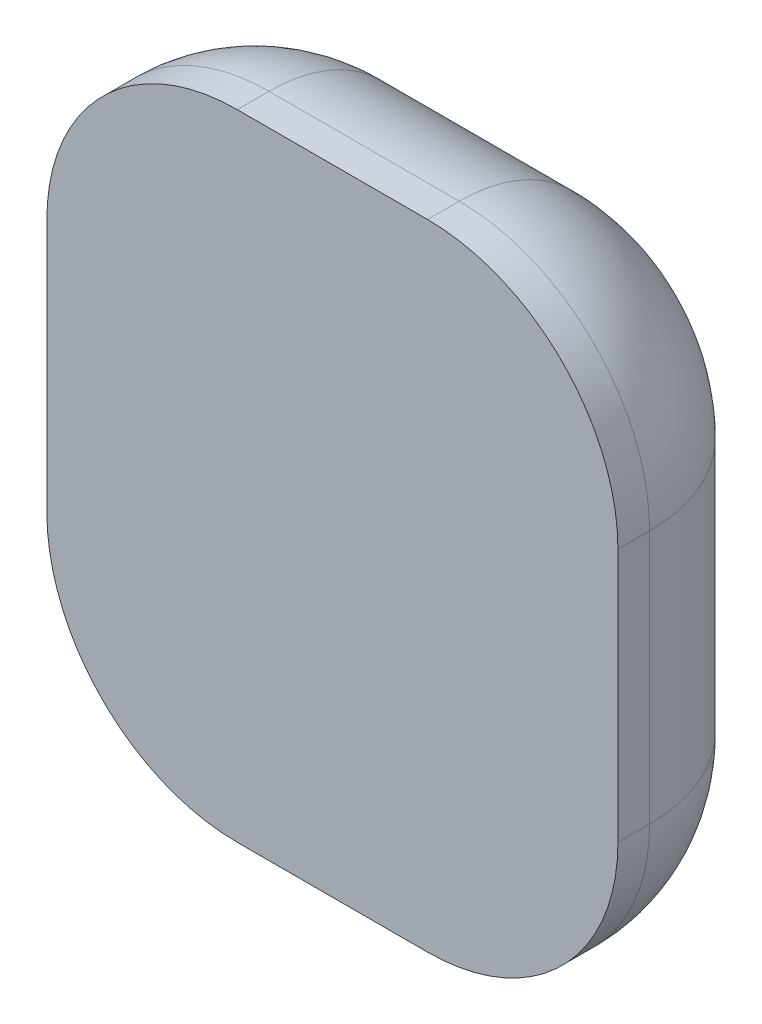
ISO-10303-21;
HEADER;
FILE_DESCRIPTION(('STEP AP214'),'2;1');
FILE_NAME('part.step','',(''),(''),'','','');
FILE_SCHEMA(('AUTOMOTIVE_DESIGN { 1 0 10303 214 1 1 1 1 }'));
ENDSEC;
DATA;
#1=APPLICATION_CONTEXT('core data for automotive mechanical design processes');
#2=APPLICATION_PROTOCOL_DEFINITION('international standard','automotive_design',2000,#1);
#3=PRODUCT_CONTEXT('',#1,'mechanical');
#4=PRODUCT('Part','Part','',(#3));
#5=PRODUCT_RELATED_PRODUCT_CATEGORY('part','',(#4));
#6=PRODUCT_DEFINITION_FORMATION('','',#4);
#7=PRODUCT_DEFINITION_CONTEXT('part definition',#1,'design');
#8=PRODUCT_DEFINITION('design','',#6,#7);
#9=PRODUCT_DEFINITION_SHAPE('','',#8);
#10=(LENGTH_UNIT() NAMED_UNIT(*) SI_UNIT(.MILLI.,.METRE.));
#11=(NAMED_UNIT(*) PLANE_ANGLE_UNIT() SI_UNIT($,.RADIAN.));
#12=(NAMED_UNIT(*) SI_UNIT($,.STERADIAN.) SOLID_ANGLE_UNIT());
#13=UNCERTAINTY_MEASURE_WITH_UNIT(LENGTH_MEASURE(1.E-05),#10,'distance_accuracy_value','');
#14=(GEOMETRIC_REPRESENTATION_CONTEXT(3) GLOBAL_UNCERTAINTY_ASSIGNED_CONTEXT((#13)) GLOBAL_UNIT_ASSIGNED_CONTEXT((#10,
#11,#12)) REPRESENTATION_CONTEXT('',''));
#15=CARTESIAN_POINT('',(0.,0.,0.));
#16=DIRECTION('',(0.,0.,1.));
#17=DIRECTION('',(1.,0.,0.));
#18=AXIS2_PLACEMENT_3D('',#15,#16,#17);
#19=CARTESIAN_POINT('',(2.94899999924089,-1.74899999924089,-7.3));
#20=DIRECTION('',(0.,0.,-1.));
#21=DIRECTION('',(1.,0.,0.));
#22=AXIS2_PLACEMENT_3D('',#19,#20,#21);
#23=PLANE('',#22);
#24=DIRECTION('',(0.,-1.,0.));
#25=VECTOR('',#24,1.);
#26=CARTESIAN_POINT('',(2.95,-2.,-7.3));
#27=LINE('',#26,#25);
#28=CARTESIAN_POINT('',(2.95,-1.8,-7.3));
#29=VERTEX_POINT('',#28);
#30=CARTESIAN_POINT('',(2.95,-2.19999999908368,-7.3));
#31=VERTEX_POINT('',#30);
#32=EDGE_CURVE('E128',#29,#31,#27,.T.);
#33=ORIENTED_EDGE('',*,*,#32,.F.);
#34=CARTESIAN_POINT('',(3.,-1.8,-7.3));
#35=DIRECTION('',(0.,0.,-1.));
#36=DIRECTION('',(-1.,0.,0.));
#37=AXIS2_PLACEMENT_3D('',#34,#35,#36);
#38=CIRCLE('',#37,0.0499999999999995);
#39=CARTESIAN_POINT('',(3.00000000091633,-1.75,-7.3));
#40=VERTEX_POINT('',#39);
#41=EDGE_CURVE('E103',#40,#29,#38,.F.);
#42=ORIENTED_EDGE('',*,*,#41,.F.);
#43=DIRECTION('',(-1.,0.,0.));
#44=VECTOR('',#43,1.);
#45=CARTESIAN_POINT('',(3.15,-1.75,-7.3));
#46=LINE('',#45,#44);
#47=CARTESIAN_POINT('',(3.3,-1.75,-7.3));
#48=VERTEX_POINT('',#47);
#49=EDGE_CURVE('E101',#48,#40,#46,.T.);
#50=ORIENTED_EDGE('',*,*,#49,.F.);
#51=CARTESIAN_POINT('',(3.3,-1.8,-7.3));
#52=DIRECTION('',(0.,0.,-1.));
#53=DIRECTION('',(-1.,0.,0.));
#54=AXIS2_PLACEMENT_3D('',#51,#52,#53);
#55=CIRCLE('',#54,0.0499999999999997);
#56=CARTESIAN_POINT('',(3.35,-1.80000000091633,-7.3));
#57=VERTEX_POINT('',#56);
#58=EDGE_CURVE('E21',#57,#48,#55,.F.);
#59=ORIENTED_EDGE('',*,*,#58,.F.);
#60=DIRECTION('',(0.,1.,0.));
#61=VECTOR('',#60,1.);
#62=CARTESIAN_POINT('',(3.35,-2.,-7.3));
#63=LINE('',#62,#61);
#64=CARTESIAN_POINT('',(3.35,-2.2,-7.3));
#65=VERTEX_POINT('',#64);
#66=EDGE_CURVE('E85',#65,#57,#63,.T.);
#67=ORIENTED_EDGE('',*,*,#66,.F.);
#68=CARTESIAN_POINT('',(3.3,-2.2,-7.3));
#69=DIRECTION('',(0.,0.,-1.));
#70=DIRECTION('',(0.,1.,0.));
#71=AXIS2_PLACEMENT_3D('',#68,#69,#70);
#72=CIRCLE('',#71,0.0500000000000006);
#73=CARTESIAN_POINT('',(3.29999999908368,-2.25,-7.3));
#74=VERTEX_POINT('',#73);
#75=EDGE_CURVE('E144',#74,#65,#72,.F.);
#76=ORIENTED_EDGE('',*,*,#75,.F.);
#77=DIRECTION('',(1.,0.,0.));
#78=VECTOR('',#77,1.);
#79=CARTESIAN_POINT('',(3.15,-2.25,-7.3));
#80=LINE('',#79,#78);
#81=CARTESIAN_POINT('',(3.,-2.25,-7.3));
#82=VERTEX_POINT('',#81);
#83=EDGE_CURVE('E123',#82,#74,#80,.T.);
#84=ORIENTED_EDGE('',*,*,#83,.F.);
#85=CARTESIAN_POINT('',(3.,-2.2,-7.3));
#86=DIRECTION('',(0.,0.,-1.));
#87=DIRECTION('',(-1.,0.,0.));
#88=AXIS2_PLACEMENT_3D('',#85,#86,#87);
#89=CIRCLE('',#88,0.0500000000000001);
#90=EDGE_CURVE('E149',#31,#82,#89,.F.);
#91=ORIENTED_EDGE('',*,*,#90,.F.);
#92=EDGE_LOOP('',(#33,#42,#50,#59,#67,#76,#84,#91));
#93=FACE_BOUND('',#92,.T.);
#94=ADVANCED_FACE('F17',(#93),#23,.T.);
#95=CARTESIAN_POINT('',(3.35,-2.2,-7.05));
#96=DIRECTION('',(0.,1.,0.));
#97=DIRECTION('',(0.,0.,1.));
#98=AXIS2_PLACEMENT_3D('',#95,#96,#97);
#99=CYLINDRICAL_SURFACE('',#98,0.250000000000001);
#100=CARTESIAN_POINT('',(3.35,-2.2,-7.05));
#101=DIRECTION('',(0.,-1.,0.));
#102=DIRECTION('',(0.,0.,-1.));
#103=AXIS2_PLACEMENT_3D('',#100,#101,#102);
#104=CIRCLE('',#103,0.250000000000001);
#105=CARTESIAN_POINT('',(3.6,-2.2,-7.05));
#106=VERTEX_POINT('',#105);
#107=EDGE_CURVE('E125',#65,#106,#104,.T.);
#108=ORIENTED_EDGE('',*,*,#107,.F.);
#109=ORIENTED_EDGE('',*,*,#66,.T.);
#110=CARTESIAN_POINT('',(3.35,-1.80000000183265,-7.05));
#111=DIRECTION('',(3.66530790094077E-08,0.999999999999999,0.));
#112=DIRECTION('',(-0.999999999999999,3.66530790094077E-08,0.));
#113=AXIS2_PLACEMENT_3D('',#110,#111,#112);
#114=CIRCLE('',#113,0.250000000000001);
#115=CARTESIAN_POINT('',(3.6,-1.80000000274898,-7.05));
#116=VERTEX_POINT('',#115);
#117=EDGE_CURVE('E98',#116,#57,#114,.T.);
#118=ORIENTED_EDGE('',*,*,#117,.F.);
#119=DIRECTION('',(0.,1.,0.));
#120=VECTOR('',#119,1.);
#121=CARTESIAN_POINT('',(3.6,-2.,-7.05));
#122=LINE('',#121,#120);
#123=EDGE_CURVE('E147',#106,#116,#122,.T.);
#124=ORIENTED_EDGE('',*,*,#123,.F.);
#125=EDGE_LOOP('',(#108,#109,#118,#124));
#126=FACE_BOUND('',#125,.T.);
#127=ADVANCED_FACE('F283',(#126),#99,.T.);
#128=CARTESIAN_POINT('',(3.3,-1.8,-7.05));
#129=DIRECTION('',(0.,0.,-1.));
#130=DIRECTION('',(-1.,0.,0.));
#131=AXIS2_PLACEMENT_3D('',#128,#129,#130);
#132=DEGENERATE_TOROIDAL_SURFACE('',#131,0.0499999999999995,0.25,.T.);
#133=ORIENTED_EDGE('',*,*,#117,.T.);
#134=ORIENTED_EDGE('',*,*,#58,.T.);
#135=CARTESIAN_POINT('',(3.3,-1.75,-7.05));
#136=DIRECTION('',(-1.,0.,0.));
#137=DIRECTION('',(0.,0.,1.));
#138=AXIS2_PLACEMENT_3D('',#135,#136,#137);
#139=CIRCLE('',#138,0.25);
#140=CARTESIAN_POINT('',(3.3,-1.5,-7.05));
#141=VERTEX_POINT('',#140);
#142=EDGE_CURVE('E96',#141,#48,#139,.T.);
#143=ORIENTED_EDGE('',*,*,#142,.F.);
#144=CARTESIAN_POINT('',(3.3,-1.8,-7.05));
#145=DIRECTION('',(0.,0.,1.));
#146=DIRECTION('',(1.,0.,0.));
#147=AXIS2_PLACEMENT_3D('',#144,#145,#146);
#148=CIRCLE('',#147,0.3);
#149=EDGE_CURVE('E163',#116,#141,#148,.T.);
#150=ORIENTED_EDGE('',*,*,#149,.F.);
#151=EDGE_LOOP('',(#133,#134,#143,#150));
#152=FACE_BOUND('',#151,.T.);
#153=ADVANCED_FACE('F92',(#152),#132,.T.);
#154=CARTESIAN_POINT('',(3.,-1.75,-7.05));
#155=DIRECTION('',(1.,0.,0.));
#156=DIRECTION('',(0.,0.,-1.));
#157=AXIS2_PLACEMENT_3D('',#154,#155,#156);
#158=CYLINDRICAL_SURFACE('',#157,0.25);
#159=ORIENTED_EDGE('',*,*,#142,.T.);
#160=ORIENTED_EDGE('',*,*,#49,.T.);
#161=CARTESIAN_POINT('',(3.00000000183265,-1.75,-7.05));
#162=DIRECTION('',(-0.999999999999999,3.66530798767694E-08,0.));
#163=DIRECTION('',(-3.66530798767694E-08,-0.999999999999999,0.));
#164=AXIS2_PLACEMENT_3D('',#161,#162,#163);
#165=CIRCLE('',#164,0.25);
#166=CARTESIAN_POINT('',(3.00000000274898,-1.5,-7.05));
#167=VERTEX_POINT('',#166);
#168=EDGE_CURVE('E107',#167,#40,#165,.T.);
#169=ORIENTED_EDGE('',*,*,#168,.F.);
#170=DIRECTION('',(-1.,0.,0.));
#171=VECTOR('',#170,1.);
#172=CARTESIAN_POINT('',(3.15,-1.5,-7.05));
#173=LINE('',#172,#171);
#174=EDGE_CURVE('E111',#141,#167,#173,.T.);
#175=ORIENTED_EDGE('',*,*,#174,.F.);
#176=EDGE_LOOP('',(#159,#160,#169,#175));
#177=FACE_BOUND('',#176,.T.);
#178=ADVANCED_FACE('F109',(#177),#158,.T.);
#179=CARTESIAN_POINT('',(3.,-1.8,-7.05));
#180=DIRECTION('',(0.,0.,-1.));
#181=DIRECTION('',(-1.,0.,0.));
#182=AXIS2_PLACEMENT_3D('',#179,#180,#181);
#183=DEGENERATE_TOROIDAL_SURFACE('',#182,0.0500000000000001,0.25,.T.);
#184=ORIENTED_EDGE('',*,*,#168,.T.);
#185=ORIENTED_EDGE('',*,*,#41,.T.);
#186=CARTESIAN_POINT('',(2.95,-1.8,-7.05));
#187=DIRECTION('',(0.,-1.,0.));
#188=DIRECTION('',(1.,0.,0.));
#189=AXIS2_PLACEMENT_3D('',#186,#187,#188);
#190=CIRCLE('',#189,0.25);
#191=CARTESIAN_POINT('',(2.7,-1.8,-7.05));
#192=VERTEX_POINT('',#191);
#193=EDGE_CURVE('E130',#192,#29,#190,.T.);
#194=ORIENTED_EDGE('',*,*,#193,.F.);
#195=CARTESIAN_POINT('',(3.,-1.8,-7.05));
#196=DIRECTION('',(0.,0.,1.));
#197=DIRECTION('',(1.,0.,0.));
#198=AXIS2_PLACEMENT_3D('',#195,#196,#197);
#199=CIRCLE('',#198,0.3);
#200=EDGE_CURVE('E217',#167,#192,#199,.T.);
#201=ORIENTED_EDGE('',*,*,#200,.F.);
#202=EDGE_LOOP('',(#184,#185,#194,#201));
#203=FACE_BOUND('',#202,.T.);
#204=ADVANCED_FACE('F299',(#203),#183,.T.);
#205=CARTESIAN_POINT('',(2.95,-1.8,-7.05));
#206=DIRECTION('',(0.,-1.,0.));
#207=DIRECTION('',(1.,0.,0.));
#208=AXIS2_PLACEMENT_3D('',#205,#206,#207);
#209=CYLINDRICAL_SURFACE('',#208,0.25);
#210=ORIENTED_EDGE('',*,*,#193,.T.);
#211=ORIENTED_EDGE('',*,*,#32,.T.);
#212=CARTESIAN_POINT('',(2.95,-2.19999999816735,-7.05));
#213=DIRECTION('',(-3.66530833462164E-08,-0.999999999999999,0.));
#214=DIRECTION('',(0.999999999999999,-3.66530833462164E-08,0.));
#215=AXIS2_PLACEMENT_3D('',#212,#213,#214);
#216=CIRCLE('',#215,0.25);
#217=CARTESIAN_POINT('',(2.7,-2.19999999725102,-7.05));
#218=VERTEX_POINT('',#217);
#219=EDGE_CURVE('E129',#218,#31,#216,.T.);
#220=ORIENTED_EDGE('',*,*,#219,.F.);
#221=DIRECTION('',(0.,-1.,0.));
#222=VECTOR('',#221,1.);
#223=CARTESIAN_POINT('',(2.7,-2.,-7.05));
#224=LINE('',#223,#222);
#225=EDGE_CURVE('E213',#192,#218,#224,.T.);
#226=ORIENTED_EDGE('',*,*,#225,.F.);
#227=EDGE_LOOP('',(#210,#211,#220,#226));
#228=FACE_BOUND('',#227,.T.);
#229=ADVANCED_FACE('F298',(#228),#209,.T.);
#230=CARTESIAN_POINT('',(3.,-2.2,-7.05));
#231=DIRECTION('',(0.,0.,-1.));
#232=DIRECTION('',(-1.,0.,0.));
#233=AXIS2_PLACEMENT_3D('',#230,#231,#232);
#234=DEGENERATE_TOROIDAL_SURFACE('',#233,0.0500000000000045,0.25,.T.);
#235=ORIENTED_EDGE('',*,*,#219,.T.);
#236=ORIENTED_EDGE('',*,*,#90,.T.);
#237=CARTESIAN_POINT('',(3.,-2.25,-7.05));
#238=DIRECTION('',(1.,0.,0.));
#239=DIRECTION('',(0.,0.,-1.));
#240=AXIS2_PLACEMENT_3D('',#237,#238,#239);
#241=CIRCLE('',#240,0.25);
#242=CARTESIAN_POINT('',(3.,-2.5,-7.05));
#243=VERTEX_POINT('',#242);
#244=EDGE_CURVE('E126',#243,#82,#241,.T.);
#245=ORIENTED_EDGE('',*,*,#244,.F.);
#246=CARTESIAN_POINT('',(3.,-2.2,-7.05));
#247=DIRECTION('',(0.,0.,1.));
#248=DIRECTION('',(1.,0.,0.));
#249=AXIS2_PLACEMENT_3D('',#246,#247,#248);
#250=CIRCLE('',#249,0.3);
#251=EDGE_CURVE('E182',#218,#243,#250,.T.);
#252=ORIENTED_EDGE('',*,*,#251,.F.);
#253=EDGE_LOOP('',(#235,#236,#245,#252));
#254=FACE_BOUND('',#253,.T.);
#255=ADVANCED_FACE('F274',(#254),#234,.T.);
#256=CARTESIAN_POINT('',(3.,-2.25,-7.05));
#257=DIRECTION('',(1.,0.,0.));
#258=DIRECTION('',(0.,0.,-1.));
#259=AXIS2_PLACEMENT_3D('',#256,#257,#258);
#260=CYLINDRICAL_SURFACE('',#259,0.25);
#261=ORIENTED_EDGE('',*,*,#244,.T.);
#262=ORIENTED_EDGE('',*,*,#83,.T.);
#263=CARTESIAN_POINT('',(3.29999999816735,-2.25,-7.05));
#264=DIRECTION('',(0.999999999999999,-3.66530850809399E-08,0.));
#265=DIRECTION('',(3.66530850809399E-08,0.999999999999999,0.));
#266=AXIS2_PLACEMENT_3D('',#263,#264,#265);
#267=CIRCLE('',#266,0.25);
#268=CARTESIAN_POINT('',(3.29999999725102,-2.5,-7.05));
#269=VERTEX_POINT('',#268);
#270=EDGE_CURVE('E148',#269,#74,#267,.T.);
#271=ORIENTED_EDGE('',*,*,#270,.F.);
#272=DIRECTION('',(1.,0.,0.));
#273=VECTOR('',#272,1.);
#274=CARTESIAN_POINT('',(3.15,-2.5,-7.05));
#275=LINE('',#274,#273);
#276=EDGE_CURVE('E179',#243,#269,#275,.T.);
#277=ORIENTED_EDGE('',*,*,#276,.F.);
#278=EDGE_LOOP('',(#261,#262,#271,#277));
#279=FACE_BOUND('',#278,.T.);
#280=ADVANCED_FACE('F295',(#279),#260,.T.);
#281=CARTESIAN_POINT('',(3.3,-2.2,-7.05));
#282=DIRECTION('',(0.,0.,-1.));
#283=DIRECTION('',(0.,1.,0.));
#284=AXIS2_PLACEMENT_3D('',#281,#282,#283);
#285=DEGENERATE_TOROIDAL_SURFACE('',#284,0.0500000000000027,0.250000000000001,.T.);
#286=ORIENTED_EDGE('',*,*,#270,.T.);
#287=ORIENTED_EDGE('',*,*,#75,.T.);
#288=ORIENTED_EDGE('',*,*,#107,.T.);
#289=CARTESIAN_POINT('',(3.3,-2.2,-7.05));
#290=DIRECTION('',(0.,0.,1.));
#291=DIRECTION('',(1.,0.,0.));
#292=AXIS2_PLACEMENT_3D('',#289,#290,#291);
#293=CIRCLE('',#292,0.3);
#294=EDGE_CURVE('E185',#269,#106,#293,.T.);
#295=ORIENTED_EDGE('',*,*,#294,.F.);
#296=EDGE_LOOP('',(#286,#287,#288,#295));
#297=FACE_BOUND('',#296,.T.);
#298=ADVANCED_FACE('F289',(#297),#285,.T.);
#299=CARTESIAN_POINT('',(3.6,-1.799,-6.999));
#300=DIRECTION('',(1.,0.,0.));
#301=DIRECTION('',(0.,-1.,0.));
#302=AXIS2_PLACEMENT_3D('',#299,#300,#301);
#303=PLANE('',#302);
#304=DIRECTION('',(0.,1.,0.));
#305=VECTOR('',#304,1.);
#306=CARTESIAN_POINT('',(3.6,-2.,-7.));
#307=LINE('',#306,#305);
#308=CARTESIAN_POINT('',(3.6,-2.2,-7.));
#309=VERTEX_POINT('',#308);
#310=CARTESIAN_POINT('',(3.6,-1.8,-7.));
#311=VERTEX_POINT('',#310);
#312=EDGE_CURVE('E143',#309,#311,#307,.T.);
#313=ORIENTED_EDGE('',*,*,#312,.F.);
#314=DIRECTION('',(0.,0.,1.));
#315=VECTOR('',#314,1.);
#316=CARTESIAN_POINT('',(3.6,-2.2,-7.025));
#317=LINE('',#316,#315);
#318=EDGE_CURVE('E245',#106,#309,#317,.T.);
#319=ORIENTED_EDGE('',*,*,#318,.F.);
#320=ORIENTED_EDGE('',*,*,#123,.T.);
#321=DIRECTION('',(0.,0.,-1.));
#322=VECTOR('',#321,1.);
#323=CARTESIAN_POINT('',(3.6,-1.8,-7.025));
#324=LINE('',#323,#322);
#325=EDGE_CURVE('E165',#311,#116,#324,.T.);
#326=ORIENTED_EDGE('',*,*,#325,.F.);
#327=EDGE_LOOP('',(#313,#319,#320,#326));
#328=FACE_BOUND('',#327,.T.);
#329=ADVANCED_FACE('F286',(#328),#303,.T.);
#330=CARTESIAN_POINT('',(3.3,-1.8,-7.05));
#331=DIRECTION('',(0.,0.,1.));
#332=DIRECTION('',(1.,0.,0.));
#333=AXIS2_PLACEMENT_3D('',#330,#331,#332);
#334=CYLINDRICAL_SURFACE('',#333,0.3);
#335=ORIENTED_EDGE('',*,*,#325,.T.);
#336=ORIENTED_EDGE('',*,*,#149,.T.);
#337=DIRECTION('',(0.,0.,-1.));
#338=VECTOR('',#337,1.);
#339=CARTESIAN_POINT('',(3.3,-1.5,-7.025));
#340=LINE('',#339,#338);
#341=CARTESIAN_POINT('',(3.3,-1.5,-7.));
#342=VERTEX_POINT('',#341);
#343=EDGE_CURVE('E162',#342,#141,#340,.T.);
#344=ORIENTED_EDGE('',*,*,#343,.F.);
#345=CARTESIAN_POINT('',(3.3,-1.8,-7.));
#346=DIRECTION('',(0.,0.,1.));
#347=DIRECTION('',(1.,0.,0.));
#348=AXIS2_PLACEMENT_3D('',#345,#346,#347);
#349=CIRCLE('',#348,0.3);
#350=EDGE_CURVE('E140',#311,#342,#349,.T.);
#351=ORIENTED_EDGE('',*,*,#350,.F.);
#352=EDGE_LOOP('',(#335,#336,#344,#351));
#353=FACE_BOUND('',#352,.T.);
#354=ADVANCED_FACE('F330',(#353),#334,.T.);
#355=CARTESIAN_POINT('',(2.999,-1.5,-6.999));
#356=DIRECTION('',(0.,1.,0.));
#357=DIRECTION('',(1.,0.,0.));
#358=AXIS2_PLACEMENT_3D('',#355,#356,#357);
#359=PLANE('',#358);
#360=DIRECTION('',(-1.,0.,0.));
#361=VECTOR('',#360,1.);
#362=CARTESIAN_POINT('',(3.15,-1.5,-7.));
#363=LINE('',#362,#361);
#364=CARTESIAN_POINT('',(3.,-1.5,-7.));
#365=VERTEX_POINT('',#364);
#366=EDGE_CURVE('E139',#342,#365,#363,.T.);
#367=ORIENTED_EDGE('',*,*,#366,.F.);
#368=ORIENTED_EDGE('',*,*,#343,.T.);
#369=ORIENTED_EDGE('',*,*,#174,.T.);
#370=DIRECTION('',(0.,0.,-1.));
#371=VECTOR('',#370,1.);
#372=CARTESIAN_POINT('',(3.,-1.5,-7.025));
#373=LINE('',#372,#371);
#374=EDGE_CURVE('E222',#365,#167,#373,.T.);
#375=ORIENTED_EDGE('',*,*,#374,.F.);
#376=EDGE_LOOP('',(#367,#368,#369,#375));
#377=FACE_BOUND('',#376,.T.);
#378=ADVANCED_FACE('F327',(#377),#359,.T.);
#379=CARTESIAN_POINT('',(3.,-1.8,-7.05));
#380=DIRECTION('',(0.,0.,1.));
#381=DIRECTION('',(1.,0.,0.));
#382=AXIS2_PLACEMENT_3D('',#379,#380,#381);
#383=CYLINDRICAL_SURFACE('',#382,0.3);
#384=ORIENTED_EDGE('',*,*,#374,.T.);
#385=ORIENTED_EDGE('',*,*,#200,.T.);
#386=DIRECTION('',(0.,0.,-1.));
#387=VECTOR('',#386,1.);
#388=CARTESIAN_POINT('',(2.7,-1.8,-7.025));
#389=LINE('',#388,#387);
#390=CARTESIAN_POINT('',(2.7,-1.8,-7.));
#391=VERTEX_POINT('',#390);
#392=EDGE_CURVE('E216',#391,#192,#389,.T.);
#393=ORIENTED_EDGE('',*,*,#392,.F.);
#394=CARTESIAN_POINT('',(3.,-1.8,-7.));
#395=DIRECTION('',(0.,0.,1.));
#396=DIRECTION('',(1.,0.,0.));
#397=AXIS2_PLACEMENT_3D('',#394,#395,#396);
#398=CIRCLE('',#397,0.3);
#399=EDGE_CURVE('E136',#365,#391,#398,.T.);
#400=ORIENTED_EDGE('',*,*,#399,.F.);
#401=EDGE_LOOP('',(#384,#385,#393,#400));
#402=FACE_BOUND('',#401,.T.);
#403=ADVANCED_FACE('F323',(#402),#383,.T.);
#404=CARTESIAN_POINT('',(2.7,-2.201,-6.999));
#405=DIRECTION('',(-1.,0.,0.));
#406=DIRECTION('',(0.,1.,0.));
#407=AXIS2_PLACEMENT_3D('',#404,#405,#406);
#408=PLANE('',#407);
#409=DIRECTION('',(0.,-1.,0.));
#410=VECTOR('',#409,1.);
#411=CARTESIAN_POINT('',(2.7,-2.,-7.));
#412=LINE('',#411,#410);
#413=CARTESIAN_POINT('',(2.7,-2.2,-7.));
#414=VERTEX_POINT('',#413);
#415=EDGE_CURVE('E135',#391,#414,#412,.T.);
#416=ORIENTED_EDGE('',*,*,#415,.F.);
#417=ORIENTED_EDGE('',*,*,#392,.T.);
#418=ORIENTED_EDGE('',*,*,#225,.T.);
#419=DIRECTION('',(0.,0.,-1.));
#420=VECTOR('',#419,1.);
#421=CARTESIAN_POINT('',(2.7,-2.2,-7.025));
#422=LINE('',#421,#420);
#423=EDGE_CURVE('E202',#414,#218,#422,.T.);
#424=ORIENTED_EDGE('',*,*,#423,.F.);
#425=EDGE_LOOP('',(#416,#417,#418,#424));
#426=FACE_BOUND('',#425,.T.);
#427=ADVANCED_FACE('F320',(#426),#408,.T.);
#428=CARTESIAN_POINT('',(3.,-2.2,-7.05));
#429=DIRECTION('',(0.,0.,1.));
#430=DIRECTION('',(1.,0.,0.));
#431=AXIS2_PLACEMENT_3D('',#428,#429,#430);
#432=CYLINDRICAL_SURFACE('',#431,0.3);
#433=ORIENTED_EDGE('',*,*,#423,.T.);
#434=ORIENTED_EDGE('',*,*,#251,.T.);
#435=DIRECTION('',(0.,0.,-1.));
#436=VECTOR('',#435,1.);
#437=CARTESIAN_POINT('',(3.,-2.5,-7.025));
#438=LINE('',#437,#436);
#439=CARTESIAN_POINT('',(3.,-2.5,-7.));
#440=VERTEX_POINT('',#439);
#441=EDGE_CURVE('E181',#440,#243,#438,.T.);
#442=ORIENTED_EDGE('',*,*,#441,.F.);
#443=CARTESIAN_POINT('',(3.,-2.2,-7.));
#444=DIRECTION('',(0.,0.,1.));
#445=DIRECTION('',(1.,0.,0.));
#446=AXIS2_PLACEMENT_3D('',#443,#444,#445);
#447=CIRCLE('',#446,0.3);
#448=EDGE_CURVE('E132',#414,#440,#447,.T.);
#449=ORIENTED_EDGE('',*,*,#448,.F.);
#450=EDGE_LOOP('',(#433,#434,#442,#449));
#451=FACE_BOUND('',#450,.T.);
#452=ADVANCED_FACE('F271',(#451),#432,.T.);
#453=CARTESIAN_POINT('',(3.301,-2.5,-6.999));
#454=DIRECTION('',(0.,-1.,0.));
#455=DIRECTION('',(-1.,0.,0.));
#456=AXIS2_PLACEMENT_3D('',#453,#454,#455);
#457=PLANE('',#456);
#458=DIRECTION('',(1.,0.,0.));
#459=VECTOR('',#458,1.);
#460=CARTESIAN_POINT('',(3.15,-2.5,-7.));
#461=LINE('',#460,#459);
#462=CARTESIAN_POINT('',(3.3,-2.5,-7.));
#463=VERTEX_POINT('',#462);
#464=EDGE_CURVE('E27',#440,#463,#461,.T.);
#465=ORIENTED_EDGE('',*,*,#464,.F.);
#466=ORIENTED_EDGE('',*,*,#441,.T.);
#467=ORIENTED_EDGE('',*,*,#276,.T.);
#468=DIRECTION('',(0.,0.,-1.));
#469=VECTOR('',#468,1.);
#470=CARTESIAN_POINT('',(3.3,-2.5,-7.025));
#471=LINE('',#470,#469);
#472=EDGE_CURVE('E36',#463,#269,#471,.T.);
#473=ORIENTED_EDGE('',*,*,#472,.F.);
#474=EDGE_LOOP('',(#465,#466,#467,#473));
#475=FACE_BOUND('',#474,.T.);
#476=ADVANCED_FACE('F262',(#475),#457,.T.);
#477=CARTESIAN_POINT('',(3.3,-2.2,-7.05));
#478=DIRECTION('',(0.,0.,1.));
#479=DIRECTION('',(1.,0.,0.));
#480=AXIS2_PLACEMENT_3D('',#477,#478,#479);
#481=CYLINDRICAL_SURFACE('',#480,0.3);
#482=ORIENTED_EDGE('',*,*,#472,.T.);
#483=ORIENTED_EDGE('',*,*,#294,.T.);
#484=ORIENTED_EDGE('',*,*,#318,.T.);
#485=CARTESIAN_POINT('',(3.3,-2.2,-7.));
#486=DIRECTION('',(0.,0.,1.));
#487=DIRECTION('',(1.,0.,0.));
#488=AXIS2_PLACEMENT_3D('',#485,#486,#487);
#489=CIRCLE('',#488,0.3);
#490=EDGE_CURVE('E11',#463,#309,#489,.T.);
#491=ORIENTED_EDGE('',*,*,#490,.F.);
#492=EDGE_LOOP('',(#482,#483,#484,#491));
#493=FACE_BOUND('',#492,.T.);
#494=ADVANCED_FACE('F291',(#493),#481,.T.);
#495=CARTESIAN_POINT('',(3.601,-1.499,-7.));
#496=DIRECTION('',(0.,0.,1.));
#497=DIRECTION('',(-1.,0.,0.));
#498=AXIS2_PLACEMENT_3D('',#495,#496,#497);
#499=PLANE('',#498);
#500=ORIENTED_EDGE('',*,*,#464,.T.);
#501=ORIENTED_EDGE('',*,*,#490,.T.);
#502=ORIENTED_EDGE('',*,*,#312,.T.);
#503=ORIENTED_EDGE('',*,*,#350,.T.);
#504=ORIENTED_EDGE('',*,*,#366,.T.);
#505=ORIENTED_EDGE('',*,*,#399,.T.);
#506=ORIENTED_EDGE('',*,*,#415,.T.);
#507=ORIENTED_EDGE('',*,*,#448,.T.);
#508=EDGE_LOOP('',(#500,#501,#502,#503,#504,#505,#506,#507));
#509=FACE_BOUND('',#508,.T.);
#510=ADVANCED_FACE('F19',(#509),#499,.T.);
#511=CLOSED_SHELL('',(#94,#127,#153,#178,#204,#229,#255,#280,#298,#329,#354,#378,#403,#427,#452,
#476,#494,#510));
#512=MANIFOLD_SOLID_BREP('B1',#511);
#513=ADVANCED_BREP_SHAPE_REPRESENTATION('',(#18,#512),#14);
#514=SHAPE_DEFINITION_REPRESENTATION(#9,#513);
ENDSEC;
END-ISO-10303-21;
